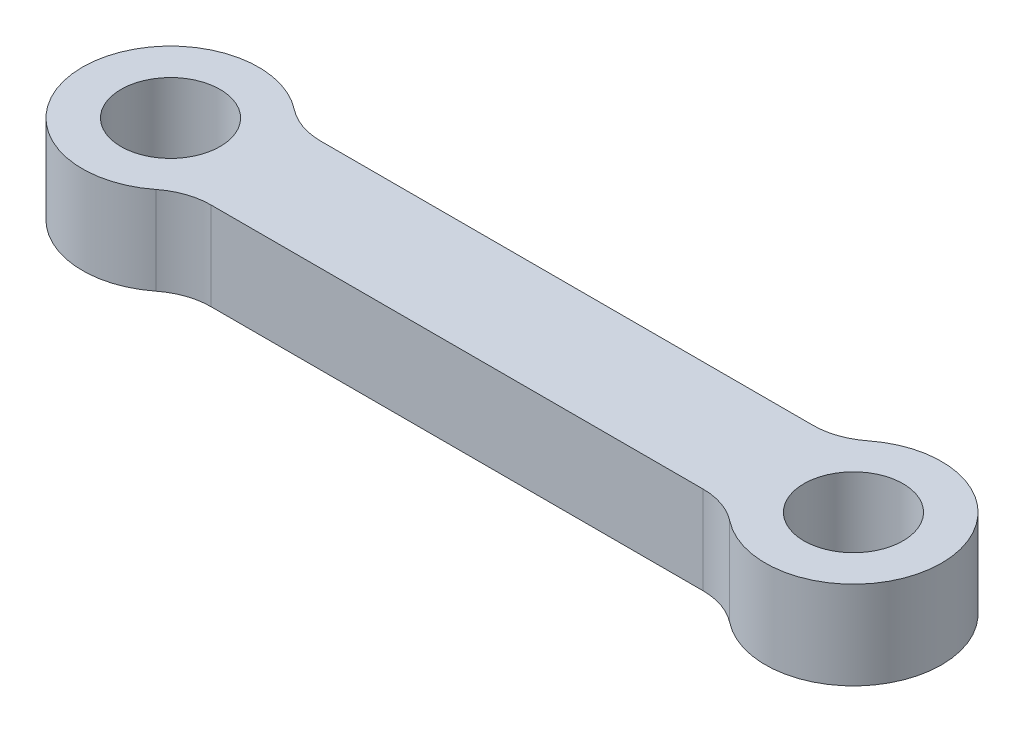
ISO-10303-21;
HEADER;
FILE_DESCRIPTION(('STEP AP214'),'2;1');
FILE_NAME('part.step','',(''),(''),'','','');
FILE_SCHEMA(('AUTOMOTIVE_DESIGN { 1 0 10303 214 1 1 1 1 }'));
ENDSEC;
DATA;
#1=APPLICATION_CONTEXT('core data for automotive mechanical design processes');
#2=APPLICATION_PROTOCOL_DEFINITION('international standard','automotive_design',2000,#1);
#3=PRODUCT_CONTEXT('',#1,'mechanical');
#4=PRODUCT('Part','Part','',(#3));
#5=PRODUCT_RELATED_PRODUCT_CATEGORY('part','',(#4));
#6=PRODUCT_DEFINITION_FORMATION('','',#4);
#7=PRODUCT_DEFINITION_CONTEXT('part definition',#1,'design');
#8=PRODUCT_DEFINITION('design','',#6,#7);
#9=PRODUCT_DEFINITION_SHAPE('','',#8);
#10=(LENGTH_UNIT() NAMED_UNIT(*) SI_UNIT(.MILLI.,.METRE.));
#11=(NAMED_UNIT(*) PLANE_ANGLE_UNIT() SI_UNIT($,.RADIAN.));
#12=(NAMED_UNIT(*) SI_UNIT($,.STERADIAN.) SOLID_ANGLE_UNIT());
#13=UNCERTAINTY_MEASURE_WITH_UNIT(LENGTH_MEASURE(1.E-05),#10,'distance_accuracy_value','');
#14=(GEOMETRIC_REPRESENTATION_CONTEXT(3) GLOBAL_UNCERTAINTY_ASSIGNED_CONTEXT((#13)) GLOBAL_UNIT_ASSIGNED_CONTEXT((#10,
#11,#12)) REPRESENTATION_CONTEXT('',''));
#15=CARTESIAN_POINT('',(0.,0.,0.));
#16=DIRECTION('',(0.,0.,1.));
#17=DIRECTION('',(1.,0.,0.));
#18=AXIS2_PLACEMENT_3D('',#15,#16,#17);
#19=CARTESIAN_POINT('',(31.,4.,0.));
#20=DIRECTION('',(0.,-1.,0.));
#21=DIRECTION('',(0.,0.,-1.));
#22=AXIS2_PLACEMENT_3D('',#19,#20,#21);
#23=CYLINDRICAL_SURFACE('',#22,4.00000000000001);
#24=CARTESIAN_POINT('',(31.,4.,0.));
#25=DIRECTION('',(0.,1.,0.));
#26=DIRECTION('',(0.,0.,1.));
#27=AXIS2_PLACEMENT_3D('',#24,#25,#26);
#28=CIRCLE('',#27,4.00000000000001);
#29=CARTESIAN_POINT('',(28.525641703473,4.,3.14285714285714));
#30=VERTEX_POINT('',#29);
#31=CARTESIAN_POINT('',(28.525641703473,4.,-3.14285714285714));
#32=VERTEX_POINT('',#31);
#33=EDGE_CURVE('E144',#30,#32,#28,.T.);
#34=ORIENTED_EDGE('',*,*,#33,.F.);
#35=DIRECTION('',(0.,-1.,0.));
#36=VECTOR('',#35,1.);
#37=CARTESIAN_POINT('',(28.525641703473,4.,3.14285714285714));
#38=LINE('',#37,#36);
#39=CARTESIAN_POINT('',(28.525641703473,0.,3.14285714285714));
#40=VERTEX_POINT('',#39);
#41=EDGE_CURVE('E152',#30,#40,#38,.T.);
#42=ORIENTED_EDGE('',*,*,#41,.T.);
#43=CARTESIAN_POINT('',(31.,0.,0.));
#44=DIRECTION('',(0.,1.,0.));
#45=DIRECTION('',(0.,0.,1.));
#46=AXIS2_PLACEMENT_3D('',#43,#44,#45);
#47=CIRCLE('',#46,4.00000000000001);
#48=CARTESIAN_POINT('',(28.525641703473,0.,-3.14285714285714));
#49=VERTEX_POINT('',#48);
#50=EDGE_CURVE('E169',#40,#49,#47,.T.);
#51=ORIENTED_EDGE('',*,*,#50,.T.);
#52=DIRECTION('',(0.,-1.,0.));
#53=VECTOR('',#52,1.);
#54=CARTESIAN_POINT('',(28.525641703473,4.,-3.14285714285714));
#55=LINE('',#54,#53);
#56=EDGE_CURVE('E150',#49,#32,#55,.F.);
#57=ORIENTED_EDGE('',*,*,#56,.T.);
#58=EDGE_LOOP('',(#34,#42,#51,#57));
#59=FACE_BOUND('',#58,.T.);
#60=ADVANCED_FACE('F38',(#59),#23,.T.);
#61=CARTESIAN_POINT('',(0.,4.,-2.5));
#62=DIRECTION('',(0.,0.,-1.));
#63=DIRECTION('',(-1.,0.,0.));
#64=AXIS2_PLACEMENT_3D('',#61,#62,#63);
#65=PLANE('',#64);
#66=DIRECTION('',(1.,0.,0.));
#67=VECTOR('',#66,1.);
#68=CARTESIAN_POINT('',(0.,4.,-2.5));
#69=LINE('',#68,#67);
#70=CARTESIAN_POINT('',(4.33012701892219,4.,-2.5));
#71=VERTEX_POINT('',#70);
#72=CARTESIAN_POINT('',(26.6698729810778,4.,-2.5));
#73=VERTEX_POINT('',#72);
#74=EDGE_CURVE('E176',#71,#73,#69,.T.);
#75=ORIENTED_EDGE('',*,*,#74,.T.);
#76=DIRECTION('',(0.,-1.,0.));
#77=VECTOR('',#76,1.);
#78=CARTESIAN_POINT('',(26.6698729810778,4.,-2.5));
#79=LINE('',#78,#77);
#80=CARTESIAN_POINT('',(26.6698729810778,0.,-2.5));
#81=VERTEX_POINT('',#80);
#82=EDGE_CURVE('E115',#73,#81,#79,.T.);
#83=ORIENTED_EDGE('',*,*,#82,.T.);
#84=DIRECTION('',(1.,0.,0.));
#85=VECTOR('',#84,1.);
#86=CARTESIAN_POINT('',(0.,0.,-2.5));
#87=LINE('',#86,#85);
#88=CARTESIAN_POINT('',(4.33012701892219,0.,-2.5));
#89=VERTEX_POINT('',#88);
#90=EDGE_CURVE('E138',#89,#81,#87,.T.);
#91=ORIENTED_EDGE('',*,*,#90,.F.);
#92=DIRECTION('',(0.,-1.,0.));
#93=VECTOR('',#92,1.);
#94=CARTESIAN_POINT('',(4.33012701892219,4.,-2.5));
#95=LINE('',#94,#93);
#96=EDGE_CURVE('E60',#89,#71,#95,.F.);
#97=ORIENTED_EDGE('',*,*,#96,.T.);
#98=EDGE_LOOP('',(#75,#83,#91,#97));
#99=FACE_BOUND('',#98,.T.);
#100=ADVANCED_FACE('F167',(#99),#65,.T.);
#101=CARTESIAN_POINT('',(0.,4.,0.));
#102=DIRECTION('',(0.,-1.,0.));
#103=DIRECTION('',(0.,0.,-1.));
#104=AXIS2_PLACEMENT_3D('',#101,#102,#103);
#105=CYLINDRICAL_SURFACE('',#104,4.);
#106=CARTESIAN_POINT('',(0.,0.,0.));
#107=DIRECTION('',(0.,1.,0.));
#108=DIRECTION('',(0.,0.,1.));
#109=AXIS2_PLACEMENT_3D('',#106,#107,#108);
#110=CIRCLE('',#109,4.);
#111=CARTESIAN_POINT('',(2.47435829652697,0.,-3.14285714285714));
#112=VERTEX_POINT('',#111);
#113=CARTESIAN_POINT('',(2.47435829652697,0.,3.14285714285714));
#114=VERTEX_POINT('',#113);
#115=EDGE_CURVE('E133',#112,#114,#110,.T.);
#116=ORIENTED_EDGE('',*,*,#115,.T.);
#117=DIRECTION('',(0.,-1.,0.));
#118=VECTOR('',#117,1.);
#119=CARTESIAN_POINT('',(2.47435829652697,4.,3.14285714285714));
#120=LINE('',#119,#118);
#121=CARTESIAN_POINT('',(2.47435829652697,4.,3.14285714285714));
#122=VERTEX_POINT('',#121);
#123=EDGE_CURVE('E109',#114,#122,#120,.F.);
#124=ORIENTED_EDGE('',*,*,#123,.T.);
#125=CARTESIAN_POINT('',(0.,4.,0.));
#126=DIRECTION('',(0.,1.,0.));
#127=DIRECTION('',(0.,0.,1.));
#128=AXIS2_PLACEMENT_3D('',#125,#126,#127);
#129=CIRCLE('',#128,4.);
#130=CARTESIAN_POINT('',(2.47435829652697,4.,-3.14285714285714));
#131=VERTEX_POINT('',#130);
#132=EDGE_CURVE('E175',#131,#122,#129,.T.);
#133=ORIENTED_EDGE('',*,*,#132,.F.);
#134=DIRECTION('',(0.,-1.,0.));
#135=VECTOR('',#134,1.);
#136=CARTESIAN_POINT('',(2.47435829652697,4.,-3.14285714285714));
#137=LINE('',#136,#135);
#138=EDGE_CURVE('E125',#131,#112,#137,.T.);
#139=ORIENTED_EDGE('',*,*,#138,.T.);
#140=EDGE_LOOP('',(#116,#124,#133,#139));
#141=FACE_BOUND('',#140,.T.);
#142=ADVANCED_FACE('F178',(#141),#105,.T.);
#143=CARTESIAN_POINT('',(0.,4.,0.));
#144=DIRECTION('',(0.,-1.,0.));
#145=DIRECTION('',(0.,0.,-1.));
#146=AXIS2_PLACEMENT_3D('',#143,#144,#145);
#147=CYLINDRICAL_SURFACE('',#146,2.25);
#148=CARTESIAN_POINT('',(0.,4.,0.));
#149=DIRECTION('',(0.,1.,0.));
#150=DIRECTION('',(0.,0.,1.));
#151=AXIS2_PLACEMENT_3D('',#148,#149,#150);
#152=CIRCLE('',#151,2.25);
#153=CARTESIAN_POINT('',(0.,4.,2.25));
#154=VERTEX_POINT('',#153);
#155=EDGE_CURVE('E180',#154,#154,#152,.T.);
#156=ORIENTED_EDGE('',*,*,#155,.T.);
#157=EDGE_LOOP('',(#156));
#158=FACE_BOUND('',#157,.T.);
#159=CARTESIAN_POINT('',(0.,0.,0.));
#160=DIRECTION('',(0.,1.,0.));
#161=DIRECTION('',(0.,0.,1.));
#162=AXIS2_PLACEMENT_3D('',#159,#160,#161);
#163=CIRCLE('',#162,2.25);
#164=CARTESIAN_POINT('',(0.,0.,2.25));
#165=VERTEX_POINT('',#164);
#166=EDGE_CURVE('E132',#165,#165,#163,.T.);
#167=ORIENTED_EDGE('',*,*,#166,.F.);
#168=EDGE_LOOP('',(#167));
#169=FACE_BOUND('',#168,.T.);
#170=ADVANCED_FACE('F226',(#158,#169),#147,.F.);
#171=CARTESIAN_POINT('',(0.,4.,2.5));
#172=DIRECTION('',(0.,0.,-1.));
#173=DIRECTION('',(-1.,0.,0.));
#174=AXIS2_PLACEMENT_3D('',#171,#172,#173);
#175=PLANE('',#174);
#176=DIRECTION('',(1.,0.,0.));
#177=VECTOR('',#176,1.);
#178=CARTESIAN_POINT('',(0.,4.,2.5));
#179=LINE('',#178,#177);
#180=CARTESIAN_POINT('',(4.3301270189222,4.,2.5));
#181=VERTEX_POINT('',#180);
#182=CARTESIAN_POINT('',(26.6698729810778,4.,2.5));
#183=VERTEX_POINT('',#182);
#184=EDGE_CURVE('E124',#181,#183,#179,.T.);
#185=ORIENTED_EDGE('',*,*,#184,.F.);
#186=DIRECTION('',(0.,1.,0.));
#187=VECTOR('',#186,1.);
#188=CARTESIAN_POINT('',(4.3301270189222,0.,2.5));
#189=LINE('',#188,#187);
#190=CARTESIAN_POINT('',(4.3301270189222,0.,2.5));
#191=VERTEX_POINT('',#190);
#192=EDGE_CURVE('E108',#181,#191,#189,.F.);
#193=ORIENTED_EDGE('',*,*,#192,.T.);
#194=DIRECTION('',(1.,0.,0.));
#195=VECTOR('',#194,1.);
#196=CARTESIAN_POINT('',(0.,0.,2.5));
#197=LINE('',#196,#195);
#198=CARTESIAN_POINT('',(26.6698729810778,0.,2.5));
#199=VERTEX_POINT('',#198);
#200=EDGE_CURVE('E121',#191,#199,#197,.T.);
#201=ORIENTED_EDGE('',*,*,#200,.T.);
#202=DIRECTION('',(0.,1.,0.));
#203=VECTOR('',#202,1.);
#204=CARTESIAN_POINT('',(26.6698729810778,4.,2.5));
#205=LINE('',#204,#203);
#206=EDGE_CURVE('E126',#199,#183,#205,.T.);
#207=ORIENTED_EDGE('',*,*,#206,.T.);
#208=EDGE_LOOP('',(#185,#193,#201,#207));
#209=FACE_BOUND('',#208,.T.);
#210=ADVANCED_FACE('F120',(#209),#175,.F.);
#211=CARTESIAN_POINT('',(31.,4.,0.));
#212=DIRECTION('',(0.,-1.,0.));
#213=DIRECTION('',(0.,0.,-1.));
#214=AXIS2_PLACEMENT_3D('',#211,#212,#213);
#215=CYLINDRICAL_SURFACE('',#214,2.25);
#216=CARTESIAN_POINT('',(31.,4.,0.));
#217=DIRECTION('',(0.,1.,0.));
#218=DIRECTION('',(0.,0.,1.));
#219=AXIS2_PLACEMENT_3D('',#216,#217,#218);
#220=CIRCLE('',#219,2.25);
#221=CARTESIAN_POINT('',(31.,4.,2.25));
#222=VERTEX_POINT('',#221);
#223=EDGE_CURVE('E145',#222,#222,#220,.T.);
#224=ORIENTED_EDGE('',*,*,#223,.T.);
#225=EDGE_LOOP('',(#224));
#226=FACE_BOUND('',#225,.T.);
#227=CARTESIAN_POINT('',(31.,0.,0.));
#228=DIRECTION('',(0.,1.,0.));
#229=DIRECTION('',(0.,0.,1.));
#230=AXIS2_PLACEMENT_3D('',#227,#228,#229);
#231=CIRCLE('',#230,2.25);
#232=CARTESIAN_POINT('',(31.,0.,2.25));
#233=VERTEX_POINT('',#232);
#234=EDGE_CURVE('E136',#233,#233,#231,.T.);
#235=ORIENTED_EDGE('',*,*,#234,.F.);
#236=EDGE_LOOP('',(#235));
#237=FACE_BOUND('',#236,.T.);
#238=ADVANCED_FACE('F220',(#226,#237),#215,.F.);
#239=CARTESIAN_POINT('',(0.,4.,0.));
#240=DIRECTION('',(0.,1.,0.));
#241=DIRECTION('',(0.,0.,1.));
#242=AXIS2_PLACEMENT_3D('',#239,#240,#241);
#243=PLANE('',#242);
#244=ORIENTED_EDGE('',*,*,#184,.T.);
#245=CARTESIAN_POINT('',(26.6698729810778,4.,5.5));
#246=DIRECTION('',(0.,1.,0.));
#247=DIRECTION('',(0.,0.,1.));
#248=AXIS2_PLACEMENT_3D('',#245,#246,#247);
#249=CIRCLE('',#248,3.);
#250=EDGE_CURVE('E160',#183,#30,#249,.F.);
#251=ORIENTED_EDGE('',*,*,#250,.T.);
#252=ORIENTED_EDGE('',*,*,#33,.T.);
#253=CARTESIAN_POINT('',(26.6698729810778,4.,-5.5));
#254=DIRECTION('',(0.,1.,0.));
#255=DIRECTION('',(0.,0.,1.));
#256=AXIS2_PLACEMENT_3D('',#253,#254,#255);
#257=CIRCLE('',#256,3.);
#258=EDGE_CURVE('E53',#32,#73,#257,.F.);
#259=ORIENTED_EDGE('',*,*,#258,.T.);
#260=ORIENTED_EDGE('',*,*,#74,.F.);
#261=CARTESIAN_POINT('',(4.33012701892219,4.,-5.5));
#262=DIRECTION('',(0.,1.,0.));
#263=DIRECTION('',(0.,0.,1.));
#264=AXIS2_PLACEMENT_3D('',#261,#262,#263);
#265=CIRCLE('',#264,3.);
#266=EDGE_CURVE('E11',#71,#131,#265,.F.);
#267=ORIENTED_EDGE('',*,*,#266,.T.);
#268=ORIENTED_EDGE('',*,*,#132,.T.);
#269=CARTESIAN_POINT('',(4.3301270189222,4.,5.5));
#270=DIRECTION('',(0.,1.,0.));
#271=DIRECTION('',(0.,0.,1.));
#272=AXIS2_PLACEMENT_3D('',#269,#270,#271);
#273=CIRCLE('',#272,3.);
#274=EDGE_CURVE('E114',#122,#181,#273,.F.);
#275=ORIENTED_EDGE('',*,*,#274,.T.);
#276=EDGE_LOOP('',(#244,#251,#252,#259,#260,#267,#268,#275));
#277=FACE_BOUND('',#276,.T.);
#278=ORIENTED_EDGE('',*,*,#155,.F.);
#279=EDGE_LOOP('',(#278));
#280=FACE_BOUND('',#279,.T.);
#281=ORIENTED_EDGE('',*,*,#223,.F.);
#282=EDGE_LOOP('',(#281));
#283=FACE_BOUND('',#282,.T.);
#284=ADVANCED_FACE('F173',(#277,#280,#283),#243,.T.);
#285=CARTESIAN_POINT('',(0.,0.,0.));
#286=DIRECTION('',(0.,1.,0.));
#287=DIRECTION('',(0.,0.,1.));
#288=AXIS2_PLACEMENT_3D('',#285,#286,#287);
#289=PLANE('',#288);
#290=ORIENTED_EDGE('',*,*,#50,.F.);
#291=CARTESIAN_POINT('',(26.6698729810778,0.,5.5));
#292=DIRECTION('',(0.,1.,0.));
#293=DIRECTION('',(0.,0.,1.));
#294=AXIS2_PLACEMENT_3D('',#291,#292,#293);
#295=CIRCLE('',#294,3.);
#296=EDGE_CURVE('E131',#40,#199,#295,.T.);
#297=ORIENTED_EDGE('',*,*,#296,.T.);
#298=ORIENTED_EDGE('',*,*,#200,.F.);
#299=CARTESIAN_POINT('',(4.3301270189222,0.,5.5));
#300=DIRECTION('',(0.,1.,0.));
#301=DIRECTION('',(0.,0.,1.));
#302=AXIS2_PLACEMENT_3D('',#299,#300,#301);
#303=CIRCLE('',#302,3.);
#304=EDGE_CURVE('E104',#191,#114,#303,.T.);
#305=ORIENTED_EDGE('',*,*,#304,.T.);
#306=ORIENTED_EDGE('',*,*,#115,.F.);
#307=CARTESIAN_POINT('',(4.33012701892219,0.,-5.5));
#308=DIRECTION('',(0.,1.,0.));
#309=DIRECTION('',(0.,0.,1.));
#310=AXIS2_PLACEMENT_3D('',#307,#308,#309);
#311=CIRCLE('',#310,3.);
#312=EDGE_CURVE('E46',#112,#89,#311,.T.);
#313=ORIENTED_EDGE('',*,*,#312,.T.);
#314=ORIENTED_EDGE('',*,*,#90,.T.);
#315=CARTESIAN_POINT('',(26.6698729810778,0.,-5.5));
#316=DIRECTION('',(0.,1.,0.));
#317=DIRECTION('',(0.,0.,1.));
#318=AXIS2_PLACEMENT_3D('',#315,#316,#317);
#319=CIRCLE('',#318,3.);
#320=EDGE_CURVE('E162',#81,#49,#319,.T.);
#321=ORIENTED_EDGE('',*,*,#320,.T.);
#322=EDGE_LOOP('',(#290,#297,#298,#305,#306,#313,#314,#321));
#323=FACE_BOUND('',#322,.T.);
#324=ORIENTED_EDGE('',*,*,#166,.T.);
#325=EDGE_LOOP('',(#324));
#326=FACE_BOUND('',#325,.T.);
#327=ORIENTED_EDGE('',*,*,#234,.T.);
#328=EDGE_LOOP('',(#327));
#329=FACE_BOUND('',#328,.T.);
#330=ADVANCED_FACE('F129',(#323,#326,#329),#289,.F.);
#331=CARTESIAN_POINT('',(4.3301270189222,4.,5.5));
#332=DIRECTION('',(0.,-1.,0.));
#333=DIRECTION('',(0.,0.,-1.));
#334=AXIS2_PLACEMENT_3D('',#331,#332,#333);
#335=CYLINDRICAL_SURFACE('',#334,3.);
#336=ORIENTED_EDGE('',*,*,#274,.F.);
#337=ORIENTED_EDGE('',*,*,#123,.F.);
#338=ORIENTED_EDGE('',*,*,#304,.F.);
#339=ORIENTED_EDGE('',*,*,#192,.F.);
#340=EDGE_LOOP('',(#336,#337,#338,#339));
#341=FACE_BOUND('',#340,.T.);
#342=ADVANCED_FACE('F107',(#341),#335,.F.);
#343=CARTESIAN_POINT('',(26.6698729810778,4.,5.5));
#344=DIRECTION('',(0.,-1.,0.));
#345=DIRECTION('',(0.,0.,-1.));
#346=AXIS2_PLACEMENT_3D('',#343,#344,#345);
#347=CYLINDRICAL_SURFACE('',#346,3.);
#348=ORIENTED_EDGE('',*,*,#250,.F.);
#349=ORIENTED_EDGE('',*,*,#206,.F.);
#350=ORIENTED_EDGE('',*,*,#296,.F.);
#351=ORIENTED_EDGE('',*,*,#41,.F.);
#352=EDGE_LOOP('',(#348,#349,#350,#351));
#353=FACE_BOUND('',#352,.T.);
#354=ADVANCED_FACE('F197',(#353),#347,.F.);
#355=CARTESIAN_POINT('',(26.6698729810778,4.,-5.5));
#356=DIRECTION('',(0.,-1.,0.));
#357=DIRECTION('',(0.,0.,-1.));
#358=AXIS2_PLACEMENT_3D('',#355,#356,#357);
#359=CYLINDRICAL_SURFACE('',#358,3.);
#360=ORIENTED_EDGE('',*,*,#258,.F.);
#361=ORIENTED_EDGE('',*,*,#56,.F.);
#362=ORIENTED_EDGE('',*,*,#320,.F.);
#363=ORIENTED_EDGE('',*,*,#82,.F.);
#364=EDGE_LOOP('',(#360,#361,#362,#363));
#365=FACE_BOUND('',#364,.T.);
#366=ADVANCED_FACE('F195',(#365),#359,.F.);
#367=CARTESIAN_POINT('',(4.33012701892219,4.,-5.5));
#368=DIRECTION('',(0.,-1.,0.));
#369=DIRECTION('',(0.,0.,-1.));
#370=AXIS2_PLACEMENT_3D('',#367,#368,#369);
#371=CYLINDRICAL_SURFACE('',#370,3.);
#372=ORIENTED_EDGE('',*,*,#266,.F.);
#373=ORIENTED_EDGE('',*,*,#96,.F.);
#374=ORIENTED_EDGE('',*,*,#312,.F.);
#375=ORIENTED_EDGE('',*,*,#138,.F.);
#376=EDGE_LOOP('',(#372,#373,#374,#375));
#377=FACE_BOUND('',#376,.T.);
#378=ADVANCED_FACE('F40',(#377),#371,.F.);
#379=CLOSED_SHELL('',(#60,#100,#142,#170,#210,#238,#284,#330,#342,#354,#366,#378));
#380=MANIFOLD_SOLID_BREP('B2',#379);
#381=ADVANCED_BREP_SHAPE_REPRESENTATION('',(#18,#380),#14);
#382=SHAPE_DEFINITION_REPRESENTATION(#9,#381);
ENDSEC;
END-ISO-10303-21;
